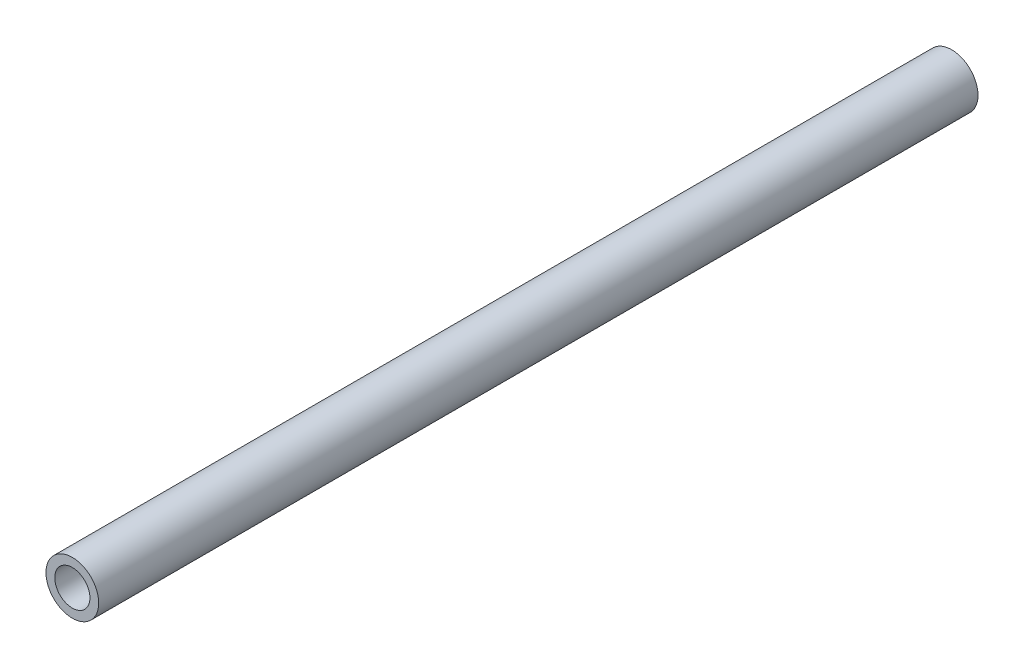
ISO-10303-21;
HEADER;
FILE_DESCRIPTION(('STEP AP214'),'2;1');
FILE_NAME('part.step','',(''),(''),'','','');
FILE_SCHEMA(('AUTOMOTIVE_DESIGN { 1 0 10303 214 1 1 1 1 }'));
ENDSEC;
DATA;
#1=APPLICATION_CONTEXT('core data for automotive mechanical design processes');
#2=APPLICATION_PROTOCOL_DEFINITION('international standard','automotive_design',2000,#1);
#3=PRODUCT_CONTEXT('',#1,'mechanical');
#4=PRODUCT('Part','Part','',(#3));
#5=PRODUCT_RELATED_PRODUCT_CATEGORY('part','',(#4));
#6=PRODUCT_DEFINITION_FORMATION('','',#4);
#7=PRODUCT_DEFINITION_CONTEXT('part definition',#1,'design');
#8=PRODUCT_DEFINITION('design','',#6,#7);
#9=PRODUCT_DEFINITION_SHAPE('','',#8);
#10=(LENGTH_UNIT() NAMED_UNIT(*) SI_UNIT(.MILLI.,.METRE.));
#11=(NAMED_UNIT(*) PLANE_ANGLE_UNIT() SI_UNIT($,.RADIAN.));
#12=(NAMED_UNIT(*) SI_UNIT($,.STERADIAN.) SOLID_ANGLE_UNIT());
#13=UNCERTAINTY_MEASURE_WITH_UNIT(LENGTH_MEASURE(1.E-05),#10,'distance_accuracy_value','');
#14=(GEOMETRIC_REPRESENTATION_CONTEXT(3) GLOBAL_UNCERTAINTY_ASSIGNED_CONTEXT((#13)) GLOBAL_UNIT_ASSIGNED_CONTEXT((#10,
#11,#12)) REPRESENTATION_CONTEXT('',''));
#15=CARTESIAN_POINT('',(0.,0.,0.));
#16=DIRECTION('',(0.,0.,1.));
#17=DIRECTION('',(1.,0.,0.));
#18=AXIS2_PLACEMENT_3D('',#15,#16,#17);
#19=CARTESIAN_POINT('',(0.,0.,50.));
#20=DIRECTION('',(0.,0.,-1.));
#21=DIRECTION('',(-1.,0.,0.));
#22=AXIS2_PLACEMENT_3D('',#19,#20,#21);
#23=CYLINDRICAL_SURFACE('',#22,3.);
#24=CARTESIAN_POINT('',(0.,0.,50.));
#25=DIRECTION('',(0.,0.,1.));
#26=DIRECTION('',(1.,0.,0.));
#27=AXIS2_PLACEMENT_3D('',#24,#25,#26);
#28=CIRCLE('',#27,3.);
#29=CARTESIAN_POINT('',(3.,0.,50.));
#30=VERTEX_POINT('',#29);
#31=EDGE_CURVE('E10',#30,#30,#28,.T.);
#32=ORIENTED_EDGE('',*,*,#31,.F.);
#33=EDGE_LOOP('',(#32));
#34=FACE_BOUND('',#33,.T.);
#35=CARTESIAN_POINT('',(0.,0.,-50.));
#36=DIRECTION('',(0.,0.,1.));
#37=DIRECTION('',(1.,0.,0.));
#38=AXIS2_PLACEMENT_3D('',#35,#36,#37);
#39=CIRCLE('',#38,3.);
#40=CARTESIAN_POINT('',(3.,0.,-50.));
#41=VERTEX_POINT('',#40);
#42=EDGE_CURVE('E36',#41,#41,#39,.T.);
#43=ORIENTED_EDGE('',*,*,#42,.T.);
#44=EDGE_LOOP('',(#43));
#45=FACE_BOUND('',#44,.T.);
#46=ADVANCED_FACE('F33',(#34,#45),#23,.T.);
#47=CARTESIAN_POINT('',(0.,0.,50.));
#48=DIRECTION('',(0.,0.,1.));
#49=DIRECTION('',(1.,0.,0.));
#50=AXIS2_PLACEMENT_3D('',#47,#48,#49);
#51=PLANE('',#50);
#52=CARTESIAN_POINT('',(0.,0.,50.));
#53=DIRECTION('',(0.,0.,1.));
#54=DIRECTION('',(1.,0.,0.));
#55=AXIS2_PLACEMENT_3D('',#52,#53,#54);
#56=CIRCLE('',#55,2.);
#57=CARTESIAN_POINT('',(2.,0.,50.));
#58=VERTEX_POINT('',#57);
#59=EDGE_CURVE('E47',#58,#58,#56,.T.);
#60=ORIENTED_EDGE('',*,*,#59,.F.);
#61=EDGE_LOOP('',(#60));
#62=FACE_BOUND('',#61,.T.);
#63=ORIENTED_EDGE('',*,*,#31,.T.);
#64=EDGE_LOOP('',(#63));
#65=FACE_BOUND('',#64,.T.);
#66=ADVANCED_FACE('F53',(#62,#65),#51,.T.);
#67=CARTESIAN_POINT('',(0.,0.,-50.));
#68=DIRECTION('',(0.,0.,1.));
#69=DIRECTION('',(1.,0.,0.));
#70=AXIS2_PLACEMENT_3D('',#67,#68,#69);
#71=PLANE('',#70);
#72=CARTESIAN_POINT('',(0.,0.,-50.));
#73=DIRECTION('',(0.,0.,1.));
#74=DIRECTION('',(1.,0.,0.));
#75=AXIS2_PLACEMENT_3D('',#72,#73,#74);
#76=CIRCLE('',#75,1.99999999999995);
#77=CARTESIAN_POINT('',(1.99999999999995,0.,-50.));
#78=VERTEX_POINT('',#77);
#79=EDGE_CURVE('E43',#78,#78,#76,.T.);
#80=ORIENTED_EDGE('',*,*,#79,.T.);
#81=EDGE_LOOP('',(#80));
#82=FACE_BOUND('',#81,.T.);
#83=ORIENTED_EDGE('',*,*,#42,.F.);
#84=EDGE_LOOP('',(#83));
#85=FACE_BOUND('',#84,.T.);
#86=ADVANCED_FACE('F55',(#82,#85),#71,.F.);
#87=CARTESIAN_POINT('',(0.,0.,50.));
#88=DIRECTION('',(0.,0.,1.));
#89=DIRECTION('',(1.,0.,0.));
#90=AXIS2_PLACEMENT_3D('',#87,#88,#89);
#91=CYLINDRICAL_SURFACE('',#90,1.99999999999995);
#92=ORIENTED_EDGE('',*,*,#79,.F.);
#93=EDGE_LOOP('',(#92));
#94=FACE_BOUND('',#93,.T.);
#95=ORIENTED_EDGE('',*,*,#59,.T.);
#96=EDGE_LOOP('',(#95));
#97=FACE_BOUND('',#96,.T.);
#98=ADVANCED_FACE('F51',(#94,#97),#91,.F.);
#99=CLOSED_SHELL('',(#46,#66,#86,#98));
#100=MANIFOLD_SOLID_BREP('B2',#99);
#101=ADVANCED_BREP_SHAPE_REPRESENTATION('',(#18,#100),#14);
#102=SHAPE_DEFINITION_REPRESENTATION(#9,#101);
ENDSEC;
END-ISO-10303-21;
